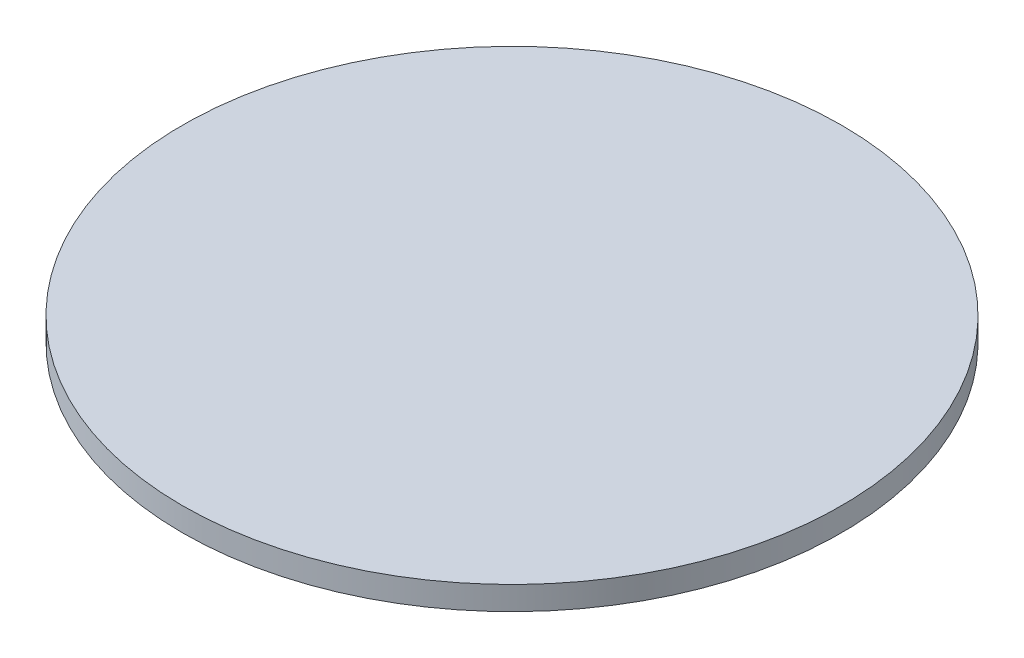
ISO-10303-21;
HEADER;
FILE_DESCRIPTION(('STEP AP214'),'2;1');
FILE_NAME('part.step','',(''),(''),'','','');
FILE_SCHEMA(('AUTOMOTIVE_DESIGN { 1 0 10303 214 1 1 1 1 }'));
ENDSEC;
DATA;
#1=APPLICATION_CONTEXT('core data for automotive mechanical design processes');
#2=APPLICATION_PROTOCOL_DEFINITION('international standard','automotive_design',2000,#1);
#3=PRODUCT_CONTEXT('',#1,'mechanical');
#4=PRODUCT('Part','Part','',(#3));
#5=PRODUCT_RELATED_PRODUCT_CATEGORY('part','',(#4));
#6=PRODUCT_DEFINITION_FORMATION('','',#4);
#7=PRODUCT_DEFINITION_CONTEXT('part definition',#1,'design');
#8=PRODUCT_DEFINITION('design','',#6,#7);
#9=PRODUCT_DEFINITION_SHAPE('','',#8);
#10=(LENGTH_UNIT() NAMED_UNIT(*) SI_UNIT(.MILLI.,.METRE.));
#11=(NAMED_UNIT(*) PLANE_ANGLE_UNIT() SI_UNIT($,.RADIAN.));
#12=(NAMED_UNIT(*) SI_UNIT($,.STERADIAN.) SOLID_ANGLE_UNIT());
#13=UNCERTAINTY_MEASURE_WITH_UNIT(LENGTH_MEASURE(1.E-05),#10,'distance_accuracy_value','');
#14=(GEOMETRIC_REPRESENTATION_CONTEXT(3) GLOBAL_UNCERTAINTY_ASSIGNED_CONTEXT((#13)) GLOBAL_UNIT_ASSIGNED_CONTEXT((#10,
#11,#12)) REPRESENTATION_CONTEXT('',''));
#15=CARTESIAN_POINT('',(0.,0.,0.));
#16=DIRECTION('',(0.,0.,1.));
#17=DIRECTION('',(1.,0.,0.));
#18=AXIS2_PLACEMENT_3D('',#15,#16,#17);
#19=CARTESIAN_POINT('',(0.,6.35,0.));
#20=DIRECTION('',(0.,-1.,0.));
#21=DIRECTION('',(0.,0.,-1.));
#22=AXIS2_PLACEMENT_3D('',#19,#20,#21);
#23=CYLINDRICAL_SURFACE('',#22,177.8);
#24=CARTESIAN_POINT('',(0.,6.35,0.));
#25=DIRECTION('',(0.,1.,0.));
#26=DIRECTION('',(0.,0.,1.));
#27=AXIS2_PLACEMENT_3D('',#24,#25,#26);
#28=CIRCLE('',#27,177.8);
#29=CARTESIAN_POINT('',(0.,6.35,177.8));
#30=VERTEX_POINT('',#29);
#31=EDGE_CURVE('E10',#30,#30,#28,.T.);
#32=ORIENTED_EDGE('',*,*,#31,.F.);
#33=EDGE_LOOP('',(#32));
#34=FACE_BOUND('',#33,.T.);
#35=CARTESIAN_POINT('',(0.,-6.35,0.));
#36=DIRECTION('',(0.,1.,0.));
#37=DIRECTION('',(0.,0.,1.));
#38=AXIS2_PLACEMENT_3D('',#35,#36,#37);
#39=CIRCLE('',#38,177.8);
#40=CARTESIAN_POINT('',(0.,-6.35,177.8));
#41=VERTEX_POINT('',#40);
#42=EDGE_CURVE('E39',#41,#41,#39,.T.);
#43=ORIENTED_EDGE('',*,*,#42,.T.);
#44=EDGE_LOOP('',(#43));
#45=FACE_BOUND('',#44,.T.);
#46=ADVANCED_FACE('F36',(#34,#45),#23,.T.);
#47=CARTESIAN_POINT('',(0.,6.35,0.));
#48=DIRECTION('',(0.,1.,0.));
#49=DIRECTION('',(0.,0.,1.));
#50=AXIS2_PLACEMENT_3D('',#47,#48,#49);
#51=PLANE('',#50);
#52=ORIENTED_EDGE('',*,*,#31,.T.);
#53=EDGE_LOOP('',(#52));
#54=FACE_BOUND('',#53,.T.);
#55=ADVANCED_FACE('F51',(#54),#51,.T.);
#56=CARTESIAN_POINT('',(0.,-6.35,0.));
#57=DIRECTION('',(0.,1.,0.));
#58=DIRECTION('',(0.,0.,1.));
#59=AXIS2_PLACEMENT_3D('',#56,#57,#58);
#60=PLANE('',#59);
#61=ORIENTED_EDGE('',*,*,#42,.F.);
#62=EDGE_LOOP('',(#61));
#63=FACE_BOUND('',#62,.T.);
#64=ADVANCED_FACE('F49',(#63),#60,.F.);
#65=CLOSED_SHELL('',(#46,#55,#64));
#66=MANIFOLD_SOLID_BREP('B2',#65);
#67=ADVANCED_BREP_SHAPE_REPRESENTATION('',(#18,#66),#14);
#68=SHAPE_DEFINITION_REPRESENTATION(#9,#67);
ENDSEC;
END-ISO-10303-21;
